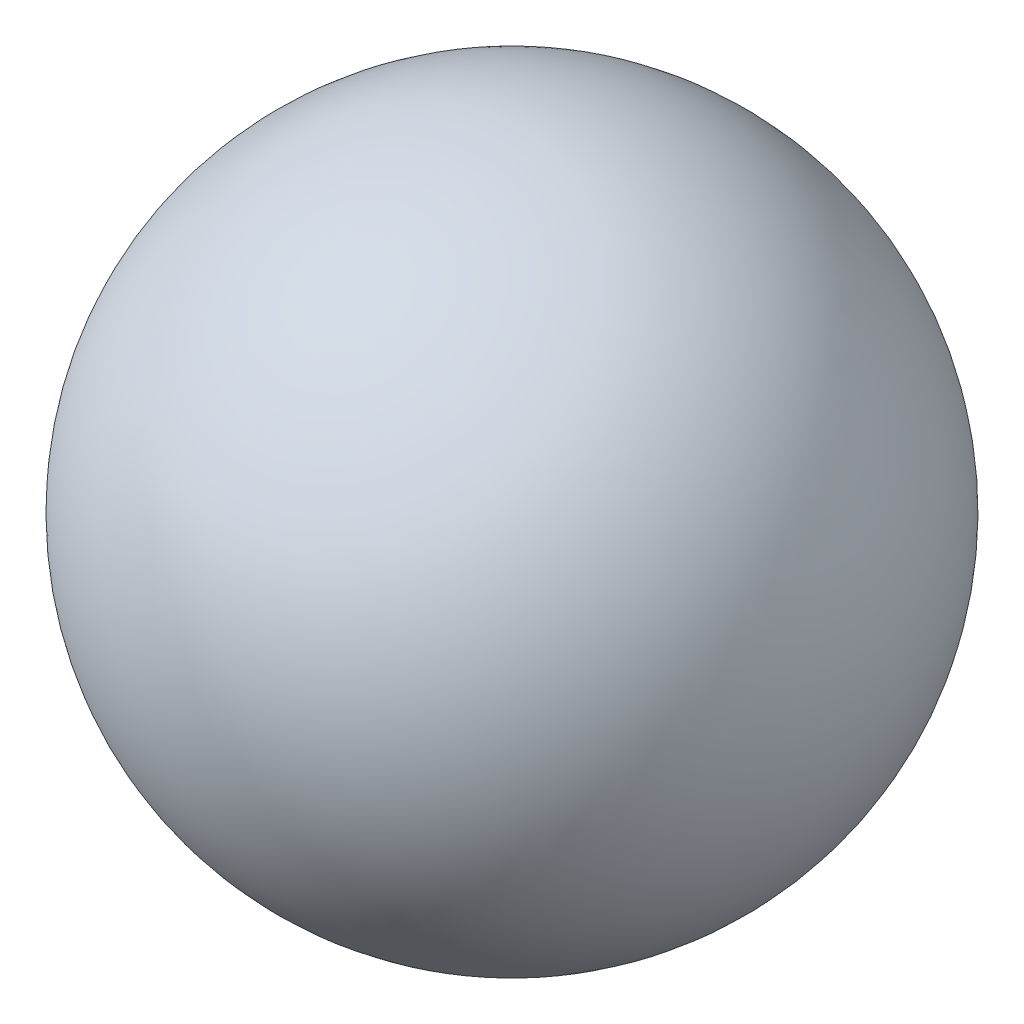
ISO-10303-21;
HEADER;
FILE_DESCRIPTION(('STEP AP214'),'2;1');
FILE_NAME('part.step','',(''),(''),'','','');
FILE_SCHEMA(('AUTOMOTIVE_DESIGN { 1 0 10303 214 1 1 1 1 }'));
ENDSEC;
DATA;
#1=APPLICATION_CONTEXT('core data for automotive mechanical design processes');
#2=APPLICATION_PROTOCOL_DEFINITION('international standard','automotive_design',2000,#1);
#3=PRODUCT_CONTEXT('',#1,'mechanical');
#4=PRODUCT('Part','Part','',(#3));
#5=PRODUCT_RELATED_PRODUCT_CATEGORY('part','',(#4));
#6=PRODUCT_DEFINITION_FORMATION('','',#4);
#7=PRODUCT_DEFINITION_CONTEXT('part definition',#1,'design');
#8=PRODUCT_DEFINITION('design','',#6,#7);
#9=PRODUCT_DEFINITION_SHAPE('','',#8);
#10=(LENGTH_UNIT() NAMED_UNIT(*) SI_UNIT(.MILLI.,.METRE.));
#11=(NAMED_UNIT(*) PLANE_ANGLE_UNIT() SI_UNIT($,.RADIAN.));
#12=(NAMED_UNIT(*) SI_UNIT($,.STERADIAN.) SOLID_ANGLE_UNIT());
#13=UNCERTAINTY_MEASURE_WITH_UNIT(LENGTH_MEASURE(1.E-05),#10,'distance_accuracy_value','');
#14=(GEOMETRIC_REPRESENTATION_CONTEXT(3) GLOBAL_UNCERTAINTY_ASSIGNED_CONTEXT((#13)) GLOBAL_UNIT_ASSIGNED_CONTEXT((#10,
#11,#12)) REPRESENTATION_CONTEXT('',''));
#15=CARTESIAN_POINT('',(0.,0.,0.));
#16=DIRECTION('',(0.,0.,1.));
#17=DIRECTION('',(1.,0.,0.));
#18=AXIS2_PLACEMENT_3D('',#15,#16,#17);
#19=CARTESIAN_POINT('',(64.16,-69.2599354328162,4.1306213627161));
#20=DIRECTION('',(0.,-0.998226300863558,0.0595336229727175));
#21=DIRECTION('',(0.173648177666934,-0.0586291734684379,-0.983061000351128));
#22=AXIS2_PLACEMENT_3D('',#19,#20,#21);
#23=SPHERICAL_SURFACE('',#22,7.15);
#24=CARTESIAN_POINT('',(64.16,-62.1226173816418,3.70495595846117));
#25=VERTEX_POINT('',#24);
#26=VERTEX_LOOP('',#25);
#27=FACE_BOUND('',#26,.T.);
#28=CARTESIAN_POINT('',(64.16,-76.3972534839907,4.55628676697103));
#29=VERTEX_POINT('',#28);
#30=VERTEX_LOOP('',#29);
#31=FACE_BOUND('',#30,.T.);
#32=ADVANCED_FACE('F15',(#27,#31),#23,.T.);
#33=CLOSED_SHELL('',(#32));
#34=MANIFOLD_SOLID_BREP('B1',#33);
#35=ADVANCED_BREP_SHAPE_REPRESENTATION('',(#18,#34),#14);
#36=SHAPE_DEFINITION_REPRESENTATION(#9,#35);
ENDSEC;
END-ISO-10303-21;
